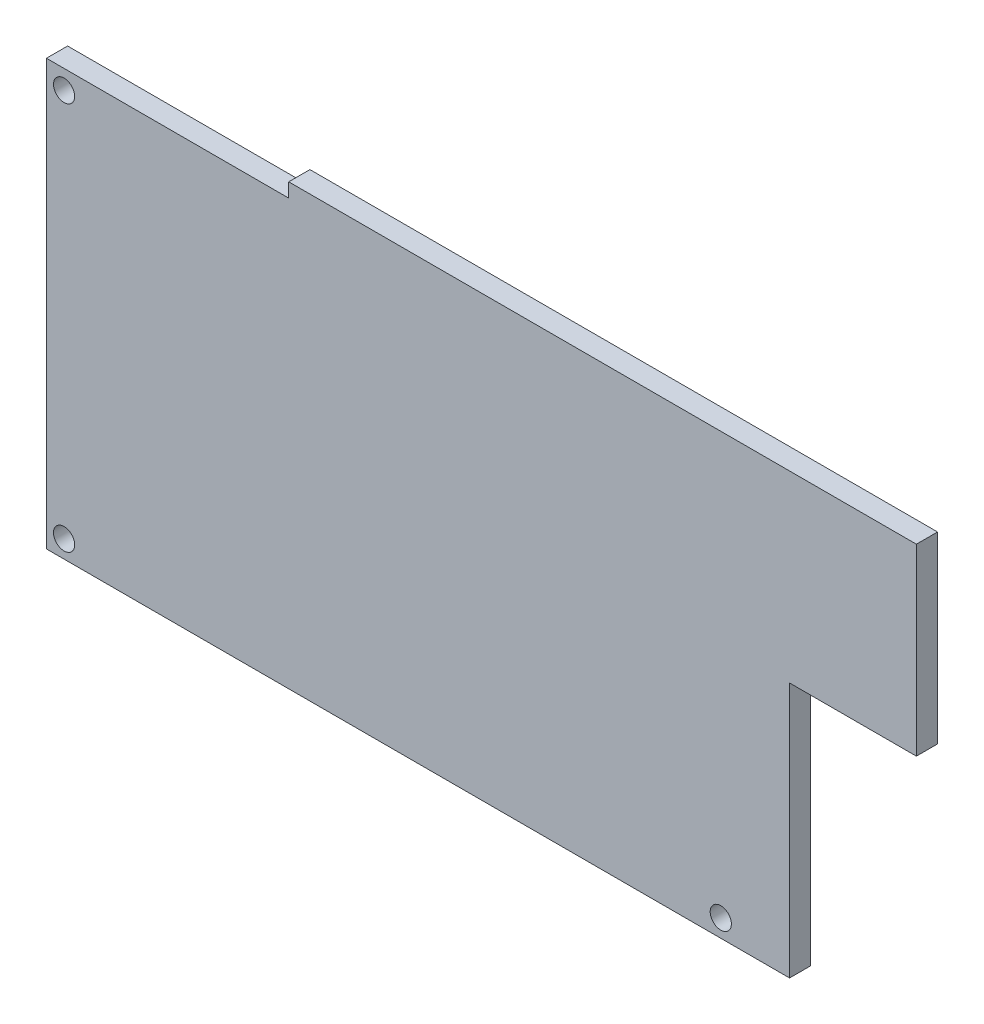
ISO-10303-21;
HEADER;
FILE_DESCRIPTION(('STEP AP214'),'2;1');
FILE_NAME('part.step','',(''),(''),'','','');
FILE_SCHEMA(('AUTOMOTIVE_DESIGN { 1 0 10303 214 1 1 1 1 }'));
ENDSEC;
DATA;
#1=APPLICATION_CONTEXT('core data for automotive mechanical design processes');
#2=APPLICATION_PROTOCOL_DEFINITION('international standard','automotive_design',2000,#1);
#3=PRODUCT_CONTEXT('',#1,'mechanical');
#4=PRODUCT('Part','Part','',(#3));
#5=PRODUCT_RELATED_PRODUCT_CATEGORY('part','',(#4));
#6=PRODUCT_DEFINITION_FORMATION('','',#4);
#7=PRODUCT_DEFINITION_CONTEXT('part definition',#1,'design');
#8=PRODUCT_DEFINITION('design','',#6,#7);
#9=PRODUCT_DEFINITION_SHAPE('','',#8);
#10=(LENGTH_UNIT() NAMED_UNIT(*) SI_UNIT(.MILLI.,.METRE.));
#11=(NAMED_UNIT(*) PLANE_ANGLE_UNIT() SI_UNIT($,.RADIAN.));
#12=(NAMED_UNIT(*) SI_UNIT($,.STERADIAN.) SOLID_ANGLE_UNIT());
#13=UNCERTAINTY_MEASURE_WITH_UNIT(LENGTH_MEASURE(1.E-05),#10,'distance_accuracy_value','');
#14=(GEOMETRIC_REPRESENTATION_CONTEXT(3) GLOBAL_UNCERTAINTY_ASSIGNED_CONTEXT((#13)) GLOBAL_UNIT_ASSIGNED_CONTEXT((#10,
#11,#12)) REPRESENTATION_CONTEXT('',''));
#15=CARTESIAN_POINT('',(0.,0.,0.));
#16=DIRECTION('',(0.,0.,1.));
#17=DIRECTION('',(1.,0.,0.));
#18=AXIS2_PLACEMENT_3D('',#15,#16,#17);
#19=CARTESIAN_POINT('',(101.918179526204,0.,3.));
#20=DIRECTION('',(1.,0.,0.));
#21=DIRECTION('',(0.,0.,-1.));
#22=AXIS2_PLACEMENT_3D('',#19,#20,#21);
#23=PLANE('',#22);
#24=DIRECTION('',(0.,-1.,0.));
#25=VECTOR('',#24,1.);
#26=CARTESIAN_POINT('',(101.918179526204,0.,0.));
#27=LINE('',#26,#25);
#28=CARTESIAN_POINT('',(101.918179526204,-100.229255365429,0.));
#29=VERTEX_POINT('',#28);
#30=CARTESIAN_POINT('',(101.918179526204,-136.414342304632,0.));
#31=VERTEX_POINT('',#30);
#32=EDGE_CURVE('E127',#29,#31,#27,.T.);
#33=ORIENTED_EDGE('',*,*,#32,.F.);
#34=DIRECTION('',(0.,0.,-1.));
#35=VECTOR('',#34,1.);
#36=CARTESIAN_POINT('',(101.918179526204,-100.229255365429,3.));
#37=LINE('',#36,#35);
#38=CARTESIAN_POINT('',(101.918179526204,-100.229255365429,3.));
#39=VERTEX_POINT('',#38);
#40=EDGE_CURVE('E11',#39,#29,#37,.T.);
#41=ORIENTED_EDGE('',*,*,#40,.F.);
#42=DIRECTION('',(0.,-1.,0.));
#43=VECTOR('',#42,1.);
#44=CARTESIAN_POINT('',(101.918179526204,0.,3.));
#45=LINE('',#44,#43);
#46=CARTESIAN_POINT('',(101.918179526204,-136.414342304632,3.));
#47=VERTEX_POINT('',#46);
#48=EDGE_CURVE('E146',#39,#47,#45,.T.);
#49=ORIENTED_EDGE('',*,*,#48,.T.);
#50=DIRECTION('',(0.,0.,-1.));
#51=VECTOR('',#50,1.);
#52=CARTESIAN_POINT('',(101.918179526204,-136.414342304632,3.));
#53=LINE('',#52,#51);
#54=EDGE_CURVE('E84',#47,#31,#53,.T.);
#55=ORIENTED_EDGE('',*,*,#54,.T.);
#56=EDGE_LOOP('',(#33,#41,#49,#55));
#57=FACE_BOUND('',#56,.T.);
#58=ADVANCED_FACE('F34',(#57),#23,.T.);
#59=CARTESIAN_POINT('',(0.,-100.229255365429,3.));
#60=DIRECTION('',(0.,-1.,0.));
#61=DIRECTION('',(0.,0.,-1.));
#62=AXIS2_PLACEMENT_3D('',#59,#60,#61);
#63=PLANE('',#62);
#64=DIRECTION('',(-1.,0.,0.));
#65=VECTOR('',#64,1.);
#66=CARTESIAN_POINT('',(0.,-100.229255365429,0.));
#67=LINE('',#66,#65);
#68=CARTESIAN_POINT('',(119.877392691899,-100.229255365429,0.));
#69=VERTEX_POINT('',#68);
#70=EDGE_CURVE('E130',#69,#29,#67,.T.);
#71=ORIENTED_EDGE('',*,*,#70,.F.);
#72=DIRECTION('',(0.,0.,-1.));
#73=VECTOR('',#72,1.);
#74=CARTESIAN_POINT('',(119.877392691899,-100.229255365429,3.));
#75=LINE('',#74,#73);
#76=CARTESIAN_POINT('',(119.877392691899,-100.229255365429,3.));
#77=VERTEX_POINT('',#76);
#78=EDGE_CURVE('E42',#77,#69,#75,.T.);
#79=ORIENTED_EDGE('',*,*,#78,.F.);
#80=DIRECTION('',(-1.,0.,0.));
#81=VECTOR('',#80,1.);
#82=CARTESIAN_POINT('',(0.,-100.229255365429,3.));
#83=LINE('',#82,#81);
#84=EDGE_CURVE('E178',#77,#39,#83,.T.);
#85=ORIENTED_EDGE('',*,*,#84,.T.);
#86=ORIENTED_EDGE('',*,*,#40,.T.);
#87=EDGE_LOOP('',(#71,#79,#85,#86));
#88=FACE_BOUND('',#87,.T.);
#89=ADVANCED_FACE('F164',(#88),#63,.T.);
#90=CARTESIAN_POINT('',(119.877392691899,0.,3.));
#91=DIRECTION('',(1.,0.,0.));
#92=DIRECTION('',(0.,0.,-1.));
#93=AXIS2_PLACEMENT_3D('',#90,#91,#92);
#94=PLANE('',#93);
#95=DIRECTION('',(0.,-1.,0.));
#96=VECTOR('',#95,1.);
#97=CARTESIAN_POINT('',(119.877392691899,0.,0.));
#98=LINE('',#97,#96);
#99=CARTESIAN_POINT('',(119.877392691899,-74.2292553654285,0.));
#100=VERTEX_POINT('',#99);
#101=EDGE_CURVE('E134',#100,#69,#98,.T.);
#102=ORIENTED_EDGE('',*,*,#101,.F.);
#103=DIRECTION('',(0.,0.,-1.));
#104=VECTOR('',#103,1.);
#105=CARTESIAN_POINT('',(119.877392691899,-74.2292553654285,3.));
#106=LINE('',#105,#104);
#107=CARTESIAN_POINT('',(119.877392691899,-74.2292553654285,3.));
#108=VERTEX_POINT('',#107);
#109=EDGE_CURVE('E153',#108,#100,#106,.T.);
#110=ORIENTED_EDGE('',*,*,#109,.F.);
#111=DIRECTION('',(0.,-1.,0.));
#112=VECTOR('',#111,1.);
#113=CARTESIAN_POINT('',(119.877392691899,0.,3.));
#114=LINE('',#113,#112);
#115=EDGE_CURVE('E160',#108,#77,#114,.T.);
#116=ORIENTED_EDGE('',*,*,#115,.T.);
#117=ORIENTED_EDGE('',*,*,#78,.T.);
#118=EDGE_LOOP('',(#102,#110,#116,#117));
#119=FACE_BOUND('',#118,.T.);
#120=ADVANCED_FACE('F158',(#119),#94,.T.);
#121=CARTESIAN_POINT('',(0.,-74.2292553654285,3.));
#122=DIRECTION('',(0.,-1.,0.));
#123=DIRECTION('',(1.,0.,0.));
#124=AXIS2_PLACEMENT_3D('',#121,#122,#123);
#125=PLANE('',#124);
#126=DIRECTION('',(-1.,0.,0.));
#127=VECTOR('',#126,1.);
#128=CARTESIAN_POINT('',(0.,-74.2292553654285,0.));
#129=LINE('',#128,#127);
#130=CARTESIAN_POINT('',(30.9908030736881,-74.2292553654285,0.));
#131=VERTEX_POINT('',#130);
#132=EDGE_CURVE('E137',#100,#131,#129,.T.);
#133=ORIENTED_EDGE('',*,*,#132,.T.);
#134=DIRECTION('',(0.,0.,-1.));
#135=VECTOR('',#134,1.);
#136=CARTESIAN_POINT('',(30.9908030736881,-74.2292553654285,3.));
#137=LINE('',#136,#135);
#138=CARTESIAN_POINT('',(30.9908030736881,-74.2292553654285,3.));
#139=VERTEX_POINT('',#138);
#140=EDGE_CURVE('E150',#139,#131,#137,.T.);
#141=ORIENTED_EDGE('',*,*,#140,.F.);
#142=DIRECTION('',(-1.,0.,0.));
#143=VECTOR('',#142,1.);
#144=CARTESIAN_POINT('',(0.,-74.2292553654285,3.));
#145=LINE('',#144,#143);
#146=EDGE_CURVE('E122',#108,#139,#145,.T.);
#147=ORIENTED_EDGE('',*,*,#146,.F.);
#148=ORIENTED_EDGE('',*,*,#109,.T.);
#149=EDGE_LOOP('',(#133,#141,#147,#148));
#150=FACE_BOUND('',#149,.T.);
#151=ADVANCED_FACE('F171',(#150),#125,.F.);
#152=CARTESIAN_POINT('',(30.9908030736881,0.,3.));
#153=DIRECTION('',(1.,0.,0.));
#154=DIRECTION('',(0.,0.,-1.));
#155=AXIS2_PLACEMENT_3D('',#152,#153,#154);
#156=PLANE('',#155);
#157=DIRECTION('',(0.,-1.,0.));
#158=VECTOR('',#157,1.);
#159=CARTESIAN_POINT('',(30.9908030736881,0.,0.));
#160=LINE('',#159,#158);
#161=CARTESIAN_POINT('',(30.9908030736881,-76.2292553654285,0.));
#162=VERTEX_POINT('',#161);
#163=EDGE_CURVE('E139',#131,#162,#160,.T.);
#164=ORIENTED_EDGE('',*,*,#163,.T.);
#165=DIRECTION('',(0.,0.,-1.));
#166=VECTOR('',#165,1.);
#167=CARTESIAN_POINT('',(30.9908030736881,-76.2292553654285,3.));
#168=LINE('',#167,#166);
#169=CARTESIAN_POINT('',(30.9908030736881,-76.2292553654285,3.));
#170=VERTEX_POINT('',#169);
#171=EDGE_CURVE('E111',#170,#162,#168,.T.);
#172=ORIENTED_EDGE('',*,*,#171,.F.);
#173=DIRECTION('',(0.,-1.,0.));
#174=VECTOR('',#173,1.);
#175=CARTESIAN_POINT('',(30.9908030736881,0.,3.));
#176=LINE('',#175,#174);
#177=EDGE_CURVE('E119',#139,#170,#176,.T.);
#178=ORIENTED_EDGE('',*,*,#177,.F.);
#179=ORIENTED_EDGE('',*,*,#140,.T.);
#180=EDGE_LOOP('',(#164,#172,#178,#179));
#181=FACE_BOUND('',#180,.T.);
#182=ADVANCED_FACE('F174',(#181),#156,.F.);
#183=CARTESIAN_POINT('',(0.,-76.2292553654285,3.));
#184=DIRECTION('',(0.,1.,0.));
#185=DIRECTION('',(0.,0.,1.));
#186=AXIS2_PLACEMENT_3D('',#183,#184,#185);
#187=PLANE('',#186);
#188=DIRECTION('',(1.,0.,0.));
#189=VECTOR('',#188,1.);
#190=CARTESIAN_POINT('',(0.,-76.2292553654285,0.));
#191=LINE('',#190,#189);
#192=CARTESIAN_POINT('',(-3.32307175270347,-76.2292553654285,0.));
#193=VERTEX_POINT('',#192);
#194=EDGE_CURVE('E110',#193,#162,#191,.T.);
#195=ORIENTED_EDGE('',*,*,#194,.F.);
#196=DIRECTION('',(0.,0.,-1.));
#197=VECTOR('',#196,1.);
#198=CARTESIAN_POINT('',(-3.32307175270347,-76.2292553654285,3.));
#199=LINE('',#198,#197);
#200=CARTESIAN_POINT('',(-3.32307175270347,-76.2292553654285,3.));
#201=VERTEX_POINT('',#200);
#202=EDGE_CURVE('E104',#201,#193,#199,.T.);
#203=ORIENTED_EDGE('',*,*,#202,.F.);
#204=DIRECTION('',(1.,0.,0.));
#205=VECTOR('',#204,1.);
#206=CARTESIAN_POINT('',(0.,-76.2292553654285,3.));
#207=LINE('',#206,#205);
#208=EDGE_CURVE('E108',#201,#170,#207,.T.);
#209=ORIENTED_EDGE('',*,*,#208,.T.);
#210=ORIENTED_EDGE('',*,*,#171,.T.);
#211=EDGE_LOOP('',(#195,#203,#209,#210));
#212=FACE_BOUND('',#211,.T.);
#213=ADVANCED_FACE('F106',(#212),#187,.T.);
#214=CARTESIAN_POINT('',(-3.32307175270347,0.,3.));
#215=DIRECTION('',(1.,0.,0.));
#216=DIRECTION('',(0.,0.,-1.));
#217=AXIS2_PLACEMENT_3D('',#214,#215,#216);
#218=PLANE('',#217);
#219=DIRECTION('',(0.,-1.,0.));
#220=VECTOR('',#219,1.);
#221=CARTESIAN_POINT('',(-3.32307175270347,0.,0.));
#222=LINE('',#221,#220);
#223=CARTESIAN_POINT('',(-3.32307175270347,-136.414342304632,0.));
#224=VERTEX_POINT('',#223);
#225=EDGE_CURVE('E77',#193,#224,#222,.T.);
#226=ORIENTED_EDGE('',*,*,#225,.T.);
#227=DIRECTION('',(0.,0.,-1.));
#228=VECTOR('',#227,1.);
#229=CARTESIAN_POINT('',(-3.32307175270347,-136.414342304632,3.));
#230=LINE('',#229,#228);
#231=CARTESIAN_POINT('',(-3.32307175270347,-136.414342304632,3.));
#232=VERTEX_POINT('',#231);
#233=EDGE_CURVE('E112',#232,#224,#230,.T.);
#234=ORIENTED_EDGE('',*,*,#233,.F.);
#235=DIRECTION('',(0.,-1.,0.));
#236=VECTOR('',#235,1.);
#237=CARTESIAN_POINT('',(-3.32307175270347,0.,3.));
#238=LINE('',#237,#236);
#239=EDGE_CURVE('E114',#201,#232,#238,.T.);
#240=ORIENTED_EDGE('',*,*,#239,.F.);
#241=ORIENTED_EDGE('',*,*,#202,.T.);
#242=EDGE_LOOP('',(#226,#234,#240,#241));
#243=FACE_BOUND('',#242,.T.);
#244=ADVANCED_FACE('F115',(#243),#218,.F.);
#245=CARTESIAN_POINT('',(0.,-136.414342304632,3.));
#246=DIRECTION('',(0.,1.,0.));
#247=DIRECTION('',(0.,0.,1.));
#248=AXIS2_PLACEMENT_3D('',#245,#246,#247);
#249=PLANE('',#248);
#250=DIRECTION('',(1.,0.,0.));
#251=VECTOR('',#250,1.);
#252=CARTESIAN_POINT('',(0.,-136.414342304632,0.));
#253=LINE('',#252,#251);
#254=EDGE_CURVE('E144',#224,#31,#253,.T.);
#255=ORIENTED_EDGE('',*,*,#254,.T.);
#256=ORIENTED_EDGE('',*,*,#54,.F.);
#257=DIRECTION('',(1.,0.,0.));
#258=VECTOR('',#257,1.);
#259=CARTESIAN_POINT('',(0.,-136.414342304632,3.));
#260=LINE('',#259,#258);
#261=EDGE_CURVE('E50',#232,#47,#260,.T.);
#262=ORIENTED_EDGE('',*,*,#261,.F.);
#263=ORIENTED_EDGE('',*,*,#233,.T.);
#264=EDGE_LOOP('',(#255,#256,#262,#263));
#265=FACE_BOUND('',#264,.T.);
#266=ADVANCED_FACE('F177',(#265),#249,.F.);
#267=CARTESIAN_POINT('',(0.,0.,3.));
#268=DIRECTION('',(0.,0.,1.));
#269=DIRECTION('',(1.,0.,0.));
#270=AXIS2_PLACEMENT_3D('',#267,#268,#269);
#271=PLANE('',#270);
#272=CARTESIAN_POINT('',(-0.823071752703471,-78.9143423046317,3.));
#273=DIRECTION('',(0.,0.,1.));
#274=DIRECTION('',(1.,0.,0.));
#275=AXIS2_PLACEMENT_3D('',#272,#273,#274);
#276=CIRCLE('',#275,1.5);
#277=CARTESIAN_POINT('',(0.676928247296532,-78.9143423046317,3.));
#278=VERTEX_POINT('',#277);
#279=EDGE_CURVE('E194',#278,#278,#276,.T.);
#280=ORIENTED_EDGE('',*,*,#279,.F.);
#281=EDGE_LOOP('',(#280));
#282=FACE_BOUND('',#281,.T.);
#283=CARTESIAN_POINT('',(-0.823071752703464,-133.914342304632,3.));
#284=DIRECTION('',(0.,0.,1.));
#285=DIRECTION('',(1.,0.,0.));
#286=AXIS2_PLACEMENT_3D('',#283,#284,#285);
#287=CIRCLE('',#286,1.50000000000001);
#288=CARTESIAN_POINT('',(0.676928247296548,-133.914342304632,3.));
#289=VERTEX_POINT('',#288);
#290=EDGE_CURVE('E188',#289,#289,#287,.T.);
#291=ORIENTED_EDGE('',*,*,#290,.F.);
#292=EDGE_LOOP('',(#291));
#293=FACE_BOUND('',#292,.T.);
#294=CARTESIAN_POINT('',(92.1769282472966,-133.914342304632,3.));
#295=DIRECTION('',(0.,0.,1.));
#296=DIRECTION('',(1.,0.,0.));
#297=AXIS2_PLACEMENT_3D('',#294,#295,#296);
#298=CIRCLE('',#297,1.5);
#299=CARTESIAN_POINT('',(93.6769282472966,-133.914342304632,3.));
#300=VERTEX_POINT('',#299);
#301=EDGE_CURVE('E131',#300,#300,#298,.T.);
#302=ORIENTED_EDGE('',*,*,#301,.F.);
#303=EDGE_LOOP('',(#302));
#304=FACE_BOUND('',#303,.T.);
#305=ORIENTED_EDGE('',*,*,#48,.F.);
#306=ORIENTED_EDGE('',*,*,#84,.F.);
#307=ORIENTED_EDGE('',*,*,#115,.F.);
#308=ORIENTED_EDGE('',*,*,#146,.T.);
#309=ORIENTED_EDGE('',*,*,#177,.T.);
#310=ORIENTED_EDGE('',*,*,#208,.F.);
#311=ORIENTED_EDGE('',*,*,#239,.T.);
#312=ORIENTED_EDGE('',*,*,#261,.T.);
#313=EDGE_LOOP('',(#305,#306,#307,#308,#309,#310,#311,#312));
#314=FACE_BOUND('',#313,.T.);
#315=ADVANCED_FACE('F117',(#282,#293,#304,#314),#271,.T.);
#316=CARTESIAN_POINT('',(0.,0.,0.));
#317=DIRECTION('',(0.,0.,1.));
#318=DIRECTION('',(1.,0.,0.));
#319=AXIS2_PLACEMENT_3D('',#316,#317,#318);
#320=PLANE('',#319);
#321=CARTESIAN_POINT('',(-0.823071752703471,-78.9143423046317,0.));
#322=DIRECTION('',(0.,0.,-1.));
#323=DIRECTION('',(-1.,0.,0.));
#324=AXIS2_PLACEMENT_3D('',#321,#322,#323);
#325=CIRCLE('',#324,1.5);
#326=CARTESIAN_POINT('',(-2.32307175270347,-78.9143423046317,0.));
#327=VERTEX_POINT('',#326);
#328=EDGE_CURVE('E197',#327,#327,#325,.T.);
#329=ORIENTED_EDGE('',*,*,#328,.F.);
#330=EDGE_LOOP('',(#329));
#331=FACE_BOUND('',#330,.T.);
#332=CARTESIAN_POINT('',(-0.823071752703464,-133.914342304632,0.));
#333=DIRECTION('',(0.,0.,-1.));
#334=DIRECTION('',(-1.,0.,0.));
#335=AXIS2_PLACEMENT_3D('',#332,#333,#334);
#336=CIRCLE('',#335,1.50000000000001);
#337=CARTESIAN_POINT('',(-2.32307175270348,-133.914342304632,0.));
#338=VERTEX_POINT('',#337);
#339=EDGE_CURVE('E191',#338,#338,#336,.T.);
#340=ORIENTED_EDGE('',*,*,#339,.F.);
#341=EDGE_LOOP('',(#340));
#342=FACE_BOUND('',#341,.T.);
#343=CARTESIAN_POINT('',(92.1769282472966,-133.914342304632,0.));
#344=DIRECTION('',(0.,0.,-1.));
#345=DIRECTION('',(-1.,0.,0.));
#346=AXIS2_PLACEMENT_3D('',#343,#344,#345);
#347=CIRCLE('',#346,1.5);
#348=CARTESIAN_POINT('',(90.6769282472966,-133.914342304632,0.));
#349=VERTEX_POINT('',#348);
#350=EDGE_CURVE('E185',#349,#349,#347,.T.);
#351=ORIENTED_EDGE('',*,*,#350,.F.);
#352=EDGE_LOOP('',(#351));
#353=FACE_BOUND('',#352,.T.);
#354=ORIENTED_EDGE('',*,*,#32,.T.);
#355=ORIENTED_EDGE('',*,*,#254,.F.);
#356=ORIENTED_EDGE('',*,*,#225,.F.);
#357=ORIENTED_EDGE('',*,*,#194,.T.);
#358=ORIENTED_EDGE('',*,*,#163,.F.);
#359=ORIENTED_EDGE('',*,*,#132,.F.);
#360=ORIENTED_EDGE('',*,*,#101,.T.);
#361=ORIENTED_EDGE('',*,*,#70,.T.);
#362=EDGE_LOOP('',(#354,#355,#356,#357,#358,#359,#360,#361));
#363=FACE_BOUND('',#362,.T.);
#364=ADVANCED_FACE('F167',(#331,#342,#353,#363),#320,.F.);
#365=CARTESIAN_POINT('',(92.1769282472966,-133.914342304632,10.));
#366=DIRECTION('',(0.,0.,-1.));
#367=DIRECTION('',(-1.,0.,0.));
#368=AXIS2_PLACEMENT_3D('',#365,#366,#367);
#369=CYLINDRICAL_SURFACE('',#368,1.5);
#370=ORIENTED_EDGE('',*,*,#301,.T.);
#371=EDGE_LOOP('',(#370));
#372=FACE_BOUND('',#371,.T.);
#373=ORIENTED_EDGE('',*,*,#350,.T.);
#374=EDGE_LOOP('',(#373));
#375=FACE_BOUND('',#374,.T.);
#376=ADVANCED_FACE('F205',(#372,#375),#369,.F.);
#377=CARTESIAN_POINT('',(-0.823071752703464,-133.914342304632,10.));
#378=DIRECTION('',(0.,0.,-1.));
#379=DIRECTION('',(-1.,0.,0.));
#380=AXIS2_PLACEMENT_3D('',#377,#378,#379);
#381=CYLINDRICAL_SURFACE('',#380,1.50000000000001);
#382=ORIENTED_EDGE('',*,*,#290,.T.);
#383=EDGE_LOOP('',(#382));
#384=FACE_BOUND('',#383,.T.);
#385=ORIENTED_EDGE('',*,*,#339,.T.);
#386=EDGE_LOOP('',(#385));
#387=FACE_BOUND('',#386,.T.);
#388=ADVANCED_FACE('F212',(#384,#387),#381,.F.);
#389=CARTESIAN_POINT('',(-0.823071752703471,-78.9143423046317,10.));
#390=DIRECTION('',(0.,0.,-1.));
#391=DIRECTION('',(-1.,0.,0.));
#392=AXIS2_PLACEMENT_3D('',#389,#390,#391);
#393=CYLINDRICAL_SURFACE('',#392,1.5);
#394=ORIENTED_EDGE('',*,*,#279,.T.);
#395=EDGE_LOOP('',(#394));
#396=FACE_BOUND('',#395,.T.);
#397=ORIENTED_EDGE('',*,*,#328,.T.);
#398=EDGE_LOOP('',(#397));
#399=FACE_BOUND('',#398,.T.);
#400=ADVANCED_FACE('F201',(#396,#399),#393,.F.);
#401=CLOSED_SHELL('',(#58,#89,#120,#151,#182,#213,#244,#266,#315,#364,#376,#388,#400));
#402=MANIFOLD_SOLID_BREP('B2',#401);
#403=ADVANCED_BREP_SHAPE_REPRESENTATION('',(#18,#402),#14);
#404=SHAPE_DEFINITION_REPRESENTATION(#9,#403);
ENDSEC;
END-ISO-10303-21;
